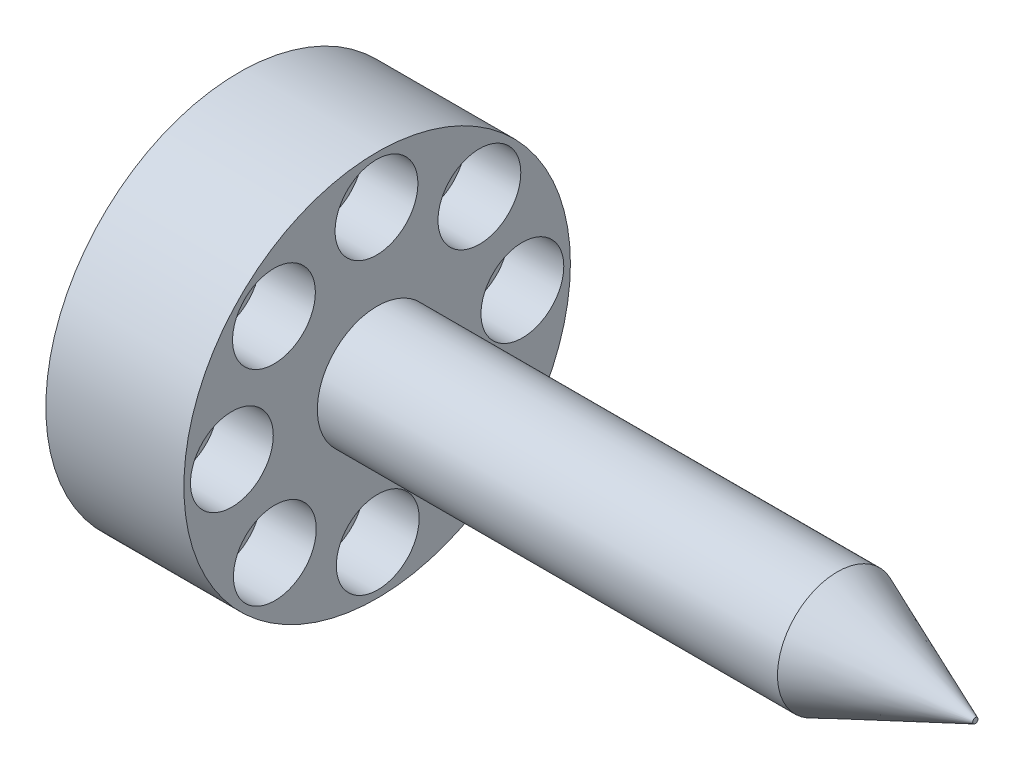
ISO-10303-21;
HEADER;
FILE_DESCRIPTION(('STEP AP214'),'2;1');
FILE_NAME('part.step','',(''),(''),'','','');
FILE_SCHEMA(('AUTOMOTIVE_DESIGN { 1 0 10303 214 1 1 1 1 }'));
ENDSEC;
DATA;
#1=APPLICATION_CONTEXT('core data for automotive mechanical design processes');
#2=APPLICATION_PROTOCOL_DEFINITION('international standard','automotive_design',2000,#1);
#3=PRODUCT_CONTEXT('',#1,'mechanical');
#4=PRODUCT('Part','Part','',(#3));
#5=PRODUCT_RELATED_PRODUCT_CATEGORY('part','',(#4));
#6=PRODUCT_DEFINITION_FORMATION('','',#4);
#7=PRODUCT_DEFINITION_CONTEXT('part definition',#1,'design');
#8=PRODUCT_DEFINITION('design','',#6,#7);
#9=PRODUCT_DEFINITION_SHAPE('','',#8);
#10=(LENGTH_UNIT() NAMED_UNIT(*) SI_UNIT(.MILLI.,.METRE.));
#11=(NAMED_UNIT(*) PLANE_ANGLE_UNIT() SI_UNIT($,.RADIAN.));
#12=(NAMED_UNIT(*) SI_UNIT($,.STERADIAN.) SOLID_ANGLE_UNIT());
#13=UNCERTAINTY_MEASURE_WITH_UNIT(LENGTH_MEASURE(1.E-05),#10,'distance_accuracy_value','');
#14=(GEOMETRIC_REPRESENTATION_CONTEXT(3) GLOBAL_UNCERTAINTY_ASSIGNED_CONTEXT((#13)) GLOBAL_UNIT_ASSIGNED_CONTEXT((#10,
#11,#12)) REPRESENTATION_CONTEXT('',''));
#15=CARTESIAN_POINT('',(0.,0.,0.));
#16=DIRECTION('',(0.,0.,1.));
#17=DIRECTION('',(1.,0.,0.));
#18=AXIS2_PLACEMENT_3D('',#15,#16,#17);
#19=CARTESIAN_POINT('',(-3515.,11.1151543393578,761.158666766789));
#20=DIRECTION('',(1.,0.,0.));
#21=DIRECTION('',(0.,0.,-1.));
#22=AXIS2_PLACEMENT_3D('',#19,#20,#21);
#23=CYLINDRICAL_SURFACE('',#22,2.50000000000002);
#24=CARTESIAN_POINT('',(470.,11.1151543393578,761.158666766789));
#25=DIRECTION('',(1.,0.,0.));
#26=DIRECTION('',(0.,0.,-1.));
#27=AXIS2_PLACEMENT_3D('',#24,#25,#26);
#28=CIRCLE('',#27,2.50000000000002);
#29=CARTESIAN_POINT('',(470.,11.1151543393578,758.658666766789));
#30=VERTEX_POINT('',#29);
#31=EDGE_CURVE('E50',#30,#30,#28,.T.);
#32=ORIENTED_EDGE('',*,*,#31,.F.);
#33=EDGE_LOOP('',(#32));
#34=FACE_BOUND('',#33,.T.);
#35=CARTESIAN_POINT('',(479.,11.1151543393578,761.158666766789));
#36=DIRECTION('',(1.,0.,0.));
#37=DIRECTION('',(0.,0.,-1.));
#38=AXIS2_PLACEMENT_3D('',#35,#36,#37);
#39=CIRCLE('',#38,2.50000000000002);
#40=CARTESIAN_POINT('',(479.,11.1151543393578,758.658666766789));
#41=VERTEX_POINT('',#40);
#42=EDGE_CURVE('E97',#41,#41,#39,.T.);
#43=ORIENTED_EDGE('',*,*,#42,.T.);
#44=EDGE_LOOP('',(#43));
#45=FACE_BOUND('',#44,.T.);
#46=ADVANCED_FACE('F33',(#34,#45),#23,.F.);
#47=CARTESIAN_POINT('',(-3515.,-15.7499699470931,749.969232067497));
#48=DIRECTION('',(1.,0.,0.));
#49=DIRECTION('',(0.,0.,-1.));
#50=AXIS2_PLACEMENT_3D('',#47,#48,#49);
#51=CYLINDRICAL_SURFACE('',#50,2.50000000000009);
#52=CARTESIAN_POINT('',(470.,-15.7499699470931,749.969232067497));
#53=DIRECTION('',(1.,0.,0.));
#54=DIRECTION('',(0.,0.,-1.));
#55=AXIS2_PLACEMENT_3D('',#52,#53,#54);
#56=CIRCLE('',#55,2.50000000000009);
#57=CARTESIAN_POINT('',(470.,-15.7499699470931,747.469232067497));
#58=VERTEX_POINT('',#57);
#59=EDGE_CURVE('E53',#58,#58,#56,.T.);
#60=ORIENTED_EDGE('',*,*,#59,.F.);
#61=EDGE_LOOP('',(#60));
#62=FACE_BOUND('',#61,.T.);
#63=CARTESIAN_POINT('',(479.,-15.7499699470931,749.969232067497));
#64=DIRECTION('',(1.,0.,0.));
#65=DIRECTION('',(0.,0.,-1.));
#66=AXIS2_PLACEMENT_3D('',#63,#64,#65);
#67=CIRCLE('',#66,2.50000000000009);
#68=CARTESIAN_POINT('',(479.,-15.7499699470931,747.469232067497));
#69=VERTEX_POINT('',#68);
#70=EDGE_CURVE('E124',#69,#69,#67,.T.);
#71=ORIENTED_EDGE('',*,*,#70,.T.);
#72=EDGE_LOOP('',(#71));
#73=FACE_BOUND('',#72,.T.);
#74=ADVANCED_FACE('F195',(#62,#73),#51,.F.);
#75=CARTESIAN_POINT('',(-3515.,-11.1586667667896,761.115154339358));
#76=DIRECTION('',(1.,0.,0.));
#77=DIRECTION('',(0.,0.,-1.));
#78=AXIS2_PLACEMENT_3D('',#75,#76,#77);
#79=CYLINDRICAL_SURFACE('',#78,2.50000000000001);
#80=CARTESIAN_POINT('',(470.,-11.1586667667896,761.115154339358));
#81=DIRECTION('',(1.,0.,0.));
#82=DIRECTION('',(0.,0.,-1.));
#83=AXIS2_PLACEMENT_3D('',#80,#81,#82);
#84=CIRCLE('',#83,2.50000000000001);
#85=CARTESIAN_POINT('',(470.,-11.1586667667896,758.615154339358));
#86=VERTEX_POINT('',#85);
#87=EDGE_CURVE('E57',#86,#86,#84,.T.);
#88=ORIENTED_EDGE('',*,*,#87,.F.);
#89=EDGE_LOOP('',(#88));
#90=FACE_BOUND('',#89,.T.);
#91=CARTESIAN_POINT('',(479.,-11.1586667667896,761.115154339358));
#92=DIRECTION('',(1.,0.,0.));
#93=DIRECTION('',(0.,0.,-1.));
#94=AXIS2_PLACEMENT_3D('',#91,#92,#93);
#95=CIRCLE('',#94,2.50000000000001);
#96=CARTESIAN_POINT('',(479.,-11.1586667667896,758.615154339358));
#97=VERTEX_POINT('',#96);
#98=EDGE_CURVE('E115',#97,#97,#95,.T.);
#99=ORIENTED_EDGE('',*,*,#98,.T.);
#100=EDGE_LOOP('',(#99));
#101=FACE_BOUND('',#100,.T.);
#102=ADVANCED_FACE('F201',(#90,#101),#79,.F.);
#103=CARTESIAN_POINT('',(-3515.,-0.0307679325027843,765.749969947093));
#104=DIRECTION('',(1.,0.,0.));
#105=DIRECTION('',(0.,0.,-1.));
#106=AXIS2_PLACEMENT_3D('',#103,#104,#105);
#107=CYLINDRICAL_SURFACE('',#106,2.50000000000003);
#108=CARTESIAN_POINT('',(470.,-0.0307679325027843,765.749969947093));
#109=DIRECTION('',(1.,0.,0.));
#110=DIRECTION('',(0.,0.,-1.));
#111=AXIS2_PLACEMENT_3D('',#108,#109,#110);
#112=CIRCLE('',#111,2.50000000000003);
#113=CARTESIAN_POINT('',(470.,-0.0307679325027843,763.249969947093));
#114=VERTEX_POINT('',#113);
#115=EDGE_CURVE('E60',#114,#114,#112,.T.);
#116=ORIENTED_EDGE('',*,*,#115,.F.);
#117=EDGE_LOOP('',(#116));
#118=FACE_BOUND('',#117,.T.);
#119=CARTESIAN_POINT('',(479.,-0.0307679325027843,765.749969947093));
#120=DIRECTION('',(1.,0.,0.));
#121=DIRECTION('',(0.,0.,-1.));
#122=AXIS2_PLACEMENT_3D('',#119,#120,#121);
#123=CIRCLE('',#122,2.50000000000003);
#124=CARTESIAN_POINT('',(479.,-0.0307679325027843,763.249969947093));
#125=VERTEX_POINT('',#124);
#126=EDGE_CURVE('E107',#125,#125,#123,.T.);
#127=ORIENTED_EDGE('',*,*,#126,.T.);
#128=EDGE_LOOP('',(#127));
#129=FACE_BOUND('',#128,.T.);
#130=ADVANCED_FACE('F301',(#118,#129),#107,.F.);
#131=CARTESIAN_POINT('',(-3515.,-11.1151543393581,738.84133323321));
#132=DIRECTION('',(1.,0.,0.));
#133=DIRECTION('',(0.,0.,-1.));
#134=AXIS2_PLACEMENT_3D('',#131,#132,#133);
#135=CYLINDRICAL_SURFACE('',#134,2.50000000000002);
#136=CARTESIAN_POINT('',(470.,-11.1151543393581,738.84133323321));
#137=DIRECTION('',(1.,0.,0.));
#138=DIRECTION('',(0.,0.,-1.));
#139=AXIS2_PLACEMENT_3D('',#136,#137,#138);
#140=CIRCLE('',#139,2.50000000000002);
#141=CARTESIAN_POINT('',(470.,-11.1151543393581,736.34133323321));
#142=VERTEX_POINT('',#141);
#143=EDGE_CURVE('E63',#142,#142,#140,.T.);
#144=ORIENTED_EDGE('',*,*,#143,.F.);
#145=EDGE_LOOP('',(#144));
#146=FACE_BOUND('',#145,.T.);
#147=CARTESIAN_POINT('',(479.,-11.1151543393581,738.84133323321));
#148=DIRECTION('',(1.,0.,0.));
#149=DIRECTION('',(0.,0.,-1.));
#150=AXIS2_PLACEMENT_3D('',#147,#148,#149);
#151=CIRCLE('',#150,2.50000000000002);
#152=CARTESIAN_POINT('',(479.,-11.1151543393581,736.34133323321));
#153=VERTEX_POINT('',#152);
#154=EDGE_CURVE('E133',#153,#153,#151,.T.);
#155=ORIENTED_EDGE('',*,*,#154,.T.);
#156=EDGE_LOOP('',(#155));
#157=FACE_BOUND('',#156,.T.);
#158=ADVANCED_FACE('F208',(#146,#157),#135,.F.);
#159=CARTESIAN_POINT('',(-3515.,0.0307679325023402,734.250030052907));
#160=DIRECTION('',(1.,0.,0.));
#161=DIRECTION('',(0.,0.,-1.));
#162=AXIS2_PLACEMENT_3D('',#159,#160,#161);
#163=CYLINDRICAL_SURFACE('',#162,2.50000000000003);
#164=CARTESIAN_POINT('',(470.,0.0307679325023402,734.250030052907));
#165=DIRECTION('',(1.,0.,0.));
#166=DIRECTION('',(0.,0.,-1.));
#167=AXIS2_PLACEMENT_3D('',#164,#165,#166);
#168=CIRCLE('',#167,2.50000000000003);
#169=CARTESIAN_POINT('',(470.,0.0307679325023402,731.750030052907));
#170=VERTEX_POINT('',#169);
#171=EDGE_CURVE('E66',#170,#170,#168,.T.);
#172=ORIENTED_EDGE('',*,*,#171,.F.);
#173=EDGE_LOOP('',(#172));
#174=FACE_BOUND('',#173,.T.);
#175=CARTESIAN_POINT('',(479.,0.0307679325023402,734.250030052907));
#176=DIRECTION('',(1.,0.,0.));
#177=DIRECTION('',(0.,0.,-1.));
#178=AXIS2_PLACEMENT_3D('',#175,#176,#177);
#179=CIRCLE('',#178,2.50000000000003);
#180=CARTESIAN_POINT('',(479.,0.0307679325023402,731.750030052907));
#181=VERTEX_POINT('',#180);
#182=EDGE_CURVE('E142',#181,#181,#179,.T.);
#183=ORIENTED_EDGE('',*,*,#182,.T.);
#184=EDGE_LOOP('',(#183));
#185=FACE_BOUND('',#184,.T.);
#186=ADVANCED_FACE('F309',(#174,#185),#163,.F.);
#187=CARTESIAN_POINT('',(-3515.,11.1586667667893,738.884845660642));
#188=DIRECTION('',(1.,0.,0.));
#189=DIRECTION('',(0.,0.,-1.));
#190=AXIS2_PLACEMENT_3D('',#187,#188,#189);
#191=CYLINDRICAL_SURFACE('',#190,2.50000000000002);
#192=CARTESIAN_POINT('',(470.,11.1586667667893,738.884845660642));
#193=DIRECTION('',(1.,0.,0.));
#194=DIRECTION('',(0.,0.,-1.));
#195=AXIS2_PLACEMENT_3D('',#192,#193,#194);
#196=CIRCLE('',#195,2.50000000000002);
#197=CARTESIAN_POINT('',(470.,11.1586667667893,736.384845660642));
#198=VERTEX_POINT('',#197);
#199=EDGE_CURVE('E68',#198,#198,#196,.T.);
#200=ORIENTED_EDGE('',*,*,#199,.F.);
#201=EDGE_LOOP('',(#200));
#202=FACE_BOUND('',#201,.T.);
#203=CARTESIAN_POINT('',(479.,11.1586667667893,738.884845660642));
#204=DIRECTION('',(1.,0.,0.));
#205=DIRECTION('',(0.,0.,-1.));
#206=AXIS2_PLACEMENT_3D('',#203,#204,#205);
#207=CIRCLE('',#206,2.50000000000002);
#208=CARTESIAN_POINT('',(479.,11.1586667667893,736.384845660642));
#209=VERTEX_POINT('',#208);
#210=EDGE_CURVE('E151',#209,#209,#207,.T.);
#211=ORIENTED_EDGE('',*,*,#210,.T.);
#212=EDGE_LOOP('',(#211));
#213=FACE_BOUND('',#212,.T.);
#214=ADVANCED_FACE('F157',(#202,#213),#191,.F.);
#215=CARTESIAN_POINT('',(-3515.,15.7499699470927,750.030767932502));
#216=DIRECTION('',(1.,0.,0.));
#217=DIRECTION('',(0.,0.,-1.));
#218=AXIS2_PLACEMENT_3D('',#215,#216,#217);
#219=CYLINDRICAL_SURFACE('',#218,2.50000000000003);
#220=CARTESIAN_POINT('',(470.,15.7499699470927,750.030767932502));
#221=DIRECTION('',(1.,0.,0.));
#222=DIRECTION('',(0.,0.,-1.));
#223=AXIS2_PLACEMENT_3D('',#220,#221,#222);
#224=CIRCLE('',#223,2.50000000000003);
#225=CARTESIAN_POINT('',(470.,15.7499699470927,747.530767932502));
#226=VERTEX_POINT('',#225);
#227=EDGE_CURVE('E37',#226,#226,#224,.T.);
#228=ORIENTED_EDGE('',*,*,#227,.F.);
#229=EDGE_LOOP('',(#228));
#230=FACE_BOUND('',#229,.T.);
#231=CARTESIAN_POINT('',(479.,15.7499699470927,750.030767932502));
#232=DIRECTION('',(1.,0.,0.));
#233=DIRECTION('',(0.,0.,-1.));
#234=AXIS2_PLACEMENT_3D('',#231,#232,#233);
#235=CIRCLE('',#234,2.50000000000003);
#236=CARTESIAN_POINT('',(479.,15.7499699470927,747.530767932502));
#237=VERTEX_POINT('',#236);
#238=EDGE_CURVE('E88',#237,#237,#235,.T.);
#239=ORIENTED_EDGE('',*,*,#238,.T.);
#240=EDGE_LOOP('',(#239));
#241=FACE_BOUND('',#240,.T.);
#242=ADVANCED_FACE('F187',(#230,#241),#219,.F.);
#243=CARTESIAN_POINT('',(485.,0.,750.));
#244=DIRECTION('',(-1.,0.,0.));
#245=DIRECTION('',(0.,0.,1.));
#246=AXIS2_PLACEMENT_3D('',#243,#244,#245);
#247=CYLINDRICAL_SURFACE('',#246,21.);
#248=CARTESIAN_POINT('',(485.,0.,750.));
#249=DIRECTION('',(1.,0.,0.));
#250=DIRECTION('',(0.,0.,-1.));
#251=AXIS2_PLACEMENT_3D('',#248,#249,#250);
#252=CIRCLE('',#251,21.);
#253=CARTESIAN_POINT('',(485.,0.,729.));
#254=VERTEX_POINT('',#253);
#255=EDGE_CURVE('E77',#254,#254,#252,.T.);
#256=ORIENTED_EDGE('',*,*,#255,.F.);
#257=EDGE_LOOP('',(#256));
#258=FACE_BOUND('',#257,.T.);
#259=CARTESIAN_POINT('',(470.,0.,750.));
#260=DIRECTION('',(1.,0.,0.));
#261=DIRECTION('',(0.,0.,-1.));
#262=AXIS2_PLACEMENT_3D('',#259,#260,#261);
#263=CIRCLE('',#262,21.);
#264=CARTESIAN_POINT('',(470.,0.,729.));
#265=VERTEX_POINT('',#264);
#266=EDGE_CURVE('E73',#265,#265,#263,.T.);
#267=ORIENTED_EDGE('',*,*,#266,.T.);
#268=EDGE_LOOP('',(#267));
#269=FACE_BOUND('',#268,.T.);
#270=ADVANCED_FACE('F177',(#258,#269),#247,.T.);
#271=CARTESIAN_POINT('',(485.,0.,750.));
#272=DIRECTION('',(1.,0.,0.));
#273=DIRECTION('',(0.,0.,-1.));
#274=AXIS2_PLACEMENT_3D('',#271,#272,#273);
#275=PLANE('',#274);
#276=CARTESIAN_POINT('',(485.,11.162397860185,761.21149181539));
#277=DIRECTION('',(1.,0.,0.));
#278=DIRECTION('',(0.,0.,-1.));
#279=AXIS2_PLACEMENT_3D('',#276,#277,#278);
#280=CIRCLE('',#279,4.49999999999991);
#281=CARTESIAN_POINT('',(485.,11.162397860185,756.71149181539));
#282=VERTEX_POINT('',#281);
#283=EDGE_CURVE('E94',#282,#282,#280,.T.);
#284=ORIENTED_EDGE('',*,*,#283,.F.);
#285=EDGE_LOOP('',(#284));
#286=FACE_BOUND('',#285,.T.);
#287=CARTESIAN_POINT('',(485.,-0.0180865978707256,765.786166924923));
#288=DIRECTION('',(1.,0.,0.));
#289=DIRECTION('',(0.,0.,-1.));
#290=AXIS2_PLACEMENT_3D('',#287,#288,#289);
#291=CIRCLE('',#290,4.49999999999979);
#292=CARTESIAN_POINT('',(485.,-0.0180865978707256,761.286166924924));
#293=VERTEX_POINT('',#292);
#294=EDGE_CURVE('E101',#293,#293,#291,.T.);
#295=ORIENTED_EDGE('',*,*,#294,.F.);
#296=EDGE_LOOP('',(#295));
#297=FACE_BOUND('',#296,.T.);
#298=CARTESIAN_POINT('',(485.,-11.1586667667896,761.115154339358));
#299=DIRECTION('',(1.,0.,0.));
#300=DIRECTION('',(0.,0.,-1.));
#301=AXIS2_PLACEMENT_3D('',#298,#299,#300);
#302=CIRCLE('',#301,4.49999999999991);
#303=CARTESIAN_POINT('',(485.,-11.1586667667896,756.615154339358));
#304=VERTEX_POINT('',#303);
#305=EDGE_CURVE('E110',#304,#304,#302,.T.);
#306=ORIENTED_EDGE('',*,*,#305,.F.);
#307=EDGE_LOOP('',(#306));
#308=FACE_BOUND('',#307,.T.);
#309=CARTESIAN_POINT('',(485.,-15.7333418763235,749.934669881302));
#310=DIRECTION('',(1.,0.,0.));
#311=DIRECTION('',(0.,0.,-1.));
#312=AXIS2_PLACEMENT_3D('',#309,#310,#311);
#313=CIRCLE('',#312,4.49999999999979);
#314=CARTESIAN_POINT('',(485.,-15.7333418763235,745.434669881303));
#315=VERTEX_POINT('',#314);
#316=EDGE_CURVE('E119',#315,#315,#313,.T.);
#317=ORIENTED_EDGE('',*,*,#316,.F.);
#318=EDGE_LOOP('',(#317));
#319=FACE_BOUND('',#318,.T.);
#320=CARTESIAN_POINT('',(485.,-11.062329290758,738.794089712383));
#321=DIRECTION('',(1.,0.,0.));
#322=DIRECTION('',(0.,0.,-1.));
#323=AXIS2_PLACEMENT_3D('',#320,#321,#322);
#324=CIRCLE('',#323,4.49999999999991);
#325=CARTESIAN_POINT('',(485.,-11.062329290758,734.294089712383));
#326=VERTEX_POINT('',#325);
#327=EDGE_CURVE('E128',#326,#326,#324,.T.);
#328=ORIENTED_EDGE('',*,*,#327,.F.);
#329=EDGE_LOOP('',(#328));
#330=FACE_BOUND('',#329,.T.);
#331=CARTESIAN_POINT('',(485.,0.11815516729774,734.219414602849));
#332=DIRECTION('',(1.,0.,0.));
#333=DIRECTION('',(0.,0.,-1.));
#334=AXIS2_PLACEMENT_3D('',#331,#332,#333);
#335=CIRCLE('',#334,4.49999999999979);
#336=CARTESIAN_POINT('',(485.,0.11815516729774,729.71941460285));
#337=VERTEX_POINT('',#336);
#338=EDGE_CURVE('E137',#337,#337,#335,.T.);
#339=ORIENTED_EDGE('',*,*,#338,.F.);
#340=EDGE_LOOP('',(#339));
#341=FACE_BOUND('',#340,.T.);
#342=CARTESIAN_POINT('',(485.,11.2587353362167,738.890427188415));
#343=DIRECTION('',(1.,0.,0.));
#344=DIRECTION('',(0.,0.,-1.));
#345=AXIS2_PLACEMENT_3D('',#342,#343,#344);
#346=CIRCLE('',#345,4.49999999999991);
#347=CARTESIAN_POINT('',(485.,11.2587353362167,734.390427188415));
#348=VERTEX_POINT('',#347);
#349=EDGE_CURVE('E146',#348,#348,#346,.T.);
#350=ORIENTED_EDGE('',*,*,#349,.F.);
#351=EDGE_LOOP('',(#350));
#352=FACE_BOUND('',#351,.T.);
#353=CARTESIAN_POINT('',(485.,15.8334104457505,750.070911646471));
#354=DIRECTION('',(1.,0.,0.));
#355=DIRECTION('',(0.,0.,-1.));
#356=AXIS2_PLACEMENT_3D('',#353,#354,#355);
#357=CIRCLE('',#356,4.49999999999991);
#358=CARTESIAN_POINT('',(485.,15.8334104457505,745.570911646471));
#359=VERTEX_POINT('',#358);
#360=EDGE_CURVE('E85',#359,#359,#357,.T.);
#361=ORIENTED_EDGE('',*,*,#360,.F.);
#362=EDGE_LOOP('',(#361));
#363=FACE_BOUND('',#362,.T.);
#364=CARTESIAN_POINT('',(485.,0.,750.));
#365=DIRECTION('',(1.,0.,0.));
#366=DIRECTION('',(0.,0.,-1.));
#367=AXIS2_PLACEMENT_3D('',#364,#365,#366);
#368=CIRCLE('',#367,6.4999999999999);
#369=CARTESIAN_POINT('',(485.,0.,743.5));
#370=VERTEX_POINT('',#369);
#371=EDGE_CURVE('E46',#370,#370,#368,.T.);
#372=ORIENTED_EDGE('',*,*,#371,.F.);
#373=EDGE_LOOP('',(#372));
#374=FACE_BOUND('',#373,.T.);
#375=ORIENTED_EDGE('',*,*,#255,.T.);
#376=EDGE_LOOP('',(#375));
#377=FACE_BOUND('',#376,.T.);
#378=ADVANCED_FACE('F173',(#286,#297,#308,#319,#330,#341,#352,#363,#374,#377),#275,.T.);
#379=CARTESIAN_POINT('',(470.,0.,750.));
#380=DIRECTION('',(1.,0.,0.));
#381=DIRECTION('',(0.,0.,-1.));
#382=AXIS2_PLACEMENT_3D('',#379,#380,#381);
#383=PLANE('',#382);
#384=ORIENTED_EDGE('',*,*,#227,.T.);
#385=EDGE_LOOP('',(#384));
#386=FACE_BOUND('',#385,.T.);
#387=ORIENTED_EDGE('',*,*,#199,.T.);
#388=EDGE_LOOP('',(#387));
#389=FACE_BOUND('',#388,.T.);
#390=ORIENTED_EDGE('',*,*,#171,.T.);
#391=EDGE_LOOP('',(#390));
#392=FACE_BOUND('',#391,.T.);
#393=ORIENTED_EDGE('',*,*,#143,.T.);
#394=EDGE_LOOP('',(#393));
#395=FACE_BOUND('',#394,.T.);
#396=ORIENTED_EDGE('',*,*,#115,.T.);
#397=EDGE_LOOP('',(#396));
#398=FACE_BOUND('',#397,.T.);
#399=ORIENTED_EDGE('',*,*,#87,.T.);
#400=EDGE_LOOP('',(#399));
#401=FACE_BOUND('',#400,.T.);
#402=ORIENTED_EDGE('',*,*,#59,.T.);
#403=EDGE_LOOP('',(#402));
#404=FACE_BOUND('',#403,.T.);
#405=ORIENTED_EDGE('',*,*,#31,.T.);
#406=EDGE_LOOP('',(#405));
#407=FACE_BOUND('',#406,.T.);
#408=ORIENTED_EDGE('',*,*,#266,.F.);
#409=EDGE_LOOP('',(#408));
#410=FACE_BOUND('',#409,.T.);
#411=ADVANCED_FACE('F176',(#386,#389,#392,#395,#398,#401,#404,#407,#410),#383,.F.);
#412=CARTESIAN_POINT('',(550.,0.,750.));
#413=DIRECTION('',(-1.,0.,0.));
#414=DIRECTION('',(0.,0.,1.));
#415=AXIS2_PLACEMENT_3D('',#412,#413,#414);
#416=CYLINDRICAL_SURFACE('',#415,6.4999999999999);
#417=CARTESIAN_POINT('',(535.,0.,750.));
#418=DIRECTION('',(1.,0.,0.));
#419=DIRECTION('',(0.,0.,-1.));
#420=AXIS2_PLACEMENT_3D('',#417,#418,#419);
#421=CIRCLE('',#420,6.4999999999999);
#422=CARTESIAN_POINT('',(535.,0.,743.5));
#423=VERTEX_POINT('',#422);
#424=EDGE_CURVE('E10',#423,#423,#421,.F.);
#425=ORIENTED_EDGE('',*,*,#424,.T.);
#426=EDGE_LOOP('',(#425));
#427=FACE_BOUND('',#426,.T.);
#428=ORIENTED_EDGE('',*,*,#371,.T.);
#429=EDGE_LOOP('',(#428));
#430=FACE_BOUND('',#429,.T.);
#431=ADVANCED_FACE('F213',(#427,#430),#416,.T.);
#432=CARTESIAN_POINT('',(550.,0.,750.));
#433=DIRECTION('',(1.,0.,0.));
#434=DIRECTION('',(0.,0.,-1.));
#435=AXIS2_PLACEMENT_3D('',#432,#433,#434);
#436=PLANE('',#435);
#437=CARTESIAN_POINT('',(550.,0.,750.));
#438=DIRECTION('',(1.,0.,0.));
#439=DIRECTION('',(0.,0.,-1.));
#440=AXIS2_PLACEMENT_3D('',#437,#438,#439);
#441=CIRCLE('',#440,0.286796564403557);
#442=CARTESIAN_POINT('',(550.,0.,749.713203435596));
#443=VERTEX_POINT('',#442);
#444=EDGE_CURVE('E41',#443,#443,#441,.T.);
#445=ORIENTED_EDGE('',*,*,#444,.T.);
#446=EDGE_LOOP('',(#445));
#447=FACE_BOUND('',#446,.T.);
#448=ADVANCED_FACE('F210',(#447),#436,.T.);
#449=CARTESIAN_POINT('',(550.,0.,750.));
#450=DIRECTION('',(-1.,0.,0.));
#451=DIRECTION('',(0.,0.,1.));
#452=AXIS2_PLACEMENT_3D('',#449,#450,#451);
#453=CONICAL_SURFACE('',#452,0.286796564403557,0.392699081698725);
#454=ORIENTED_EDGE('',*,*,#424,.F.);
#455=EDGE_LOOP('',(#454));
#456=FACE_BOUND('',#455,.T.);
#457=ORIENTED_EDGE('',*,*,#444,.F.);
#458=EDGE_LOOP('',(#457));
#459=FACE_BOUND('',#458,.T.);
#460=ADVANCED_FACE('F35',(#456,#459),#453,.T.);
#461=CARTESIAN_POINT('',(479.,15.8334104457505,750.070911646471));
#462=DIRECTION('',(1.,0.,0.));
#463=DIRECTION('',(0.,0.,-1.));
#464=AXIS2_PLACEMENT_3D('',#461,#462,#463);
#465=CYLINDRICAL_SURFACE('',#464,4.49999999999991);
#466=CARTESIAN_POINT('',(479.,15.8334104457505,750.070911646471));
#467=DIRECTION('',(1.,0.,0.));
#468=DIRECTION('',(0.,0.,-1.));
#469=AXIS2_PLACEMENT_3D('',#466,#467,#468);
#470=CIRCLE('',#469,4.49999999999991);
#471=CARTESIAN_POINT('',(479.,15.8334104457505,745.570911646471));
#472=VERTEX_POINT('',#471);
#473=EDGE_CURVE('E54',#472,#472,#470,.T.);
#474=ORIENTED_EDGE('',*,*,#473,.F.);
#475=EDGE_LOOP('',(#474));
#476=FACE_BOUND('',#475,.T.);
#477=ORIENTED_EDGE('',*,*,#360,.T.);
#478=EDGE_LOOP('',(#477));
#479=FACE_BOUND('',#478,.T.);
#480=ADVANCED_FACE('F296',(#476,#479),#465,.F.);
#481=CARTESIAN_POINT('',(479.,0.,0.));
#482=DIRECTION('',(1.,0.,0.));
#483=DIRECTION('',(0.,0.,-1.));
#484=AXIS2_PLACEMENT_3D('',#481,#482,#483);
#485=PLANE('',#484);
#486=ORIENTED_EDGE('',*,*,#238,.F.);
#487=EDGE_LOOP('',(#486));
#488=FACE_BOUND('',#487,.T.);
#489=ORIENTED_EDGE('',*,*,#473,.T.);
#490=EDGE_LOOP('',(#489));
#491=FACE_BOUND('',#490,.T.);
#492=ADVANCED_FACE('F169',(#488,#491),#485,.T.);
#493=CARTESIAN_POINT('',(479.,11.2587353362167,738.890427188415));
#494=DIRECTION('',(1.,0.,0.));
#495=DIRECTION('',(0.,0.,-1.));
#496=AXIS2_PLACEMENT_3D('',#493,#494,#495);
#497=CYLINDRICAL_SURFACE('',#496,4.49999999999991);
#498=CARTESIAN_POINT('',(479.,11.2587353362167,738.890427188415));
#499=DIRECTION('',(1.,0.,0.));
#500=DIRECTION('',(0.,0.,-1.));
#501=AXIS2_PLACEMENT_3D('',#498,#499,#500);
#502=CIRCLE('',#501,4.49999999999991);
#503=CARTESIAN_POINT('',(479.,11.2587353362167,734.390427188415));
#504=VERTEX_POINT('',#503);
#505=EDGE_CURVE('E89',#504,#504,#502,.T.);
#506=ORIENTED_EDGE('',*,*,#505,.F.);
#507=EDGE_LOOP('',(#506));
#508=FACE_BOUND('',#507,.T.);
#509=ORIENTED_EDGE('',*,*,#349,.T.);
#510=EDGE_LOOP('',(#509));
#511=FACE_BOUND('',#510,.T.);
#512=ADVANCED_FACE('F163',(#508,#511),#497,.F.);
#513=CARTESIAN_POINT('',(479.,0.,0.));
#514=DIRECTION('',(1.,0.,0.));
#515=DIRECTION('',(0.,0.,-1.));
#516=AXIS2_PLACEMENT_3D('',#513,#514,#515);
#517=PLANE('',#516);
#518=ORIENTED_EDGE('',*,*,#210,.F.);
#519=EDGE_LOOP('',(#518));
#520=FACE_BOUND('',#519,.T.);
#521=ORIENTED_EDGE('',*,*,#505,.T.);
#522=EDGE_LOOP('',(#521));
#523=FACE_BOUND('',#522,.T.);
#524=ADVANCED_FACE('F159',(#520,#523),#517,.T.);
#525=CARTESIAN_POINT('',(479.,0.11815516729774,734.219414602849));
#526=DIRECTION('',(1.,0.,0.));
#527=DIRECTION('',(0.,0.,-1.));
#528=AXIS2_PLACEMENT_3D('',#525,#526,#527);
#529=CYLINDRICAL_SURFACE('',#528,4.49999999999979);
#530=CARTESIAN_POINT('',(479.,0.11815516729774,734.219414602849));
#531=DIRECTION('',(1.,0.,0.));
#532=DIRECTION('',(0.,0.,-1.));
#533=AXIS2_PLACEMENT_3D('',#530,#531,#532);
#534=CIRCLE('',#533,4.49999999999979);
#535=CARTESIAN_POINT('',(479.,0.11815516729774,729.71941460285));
#536=VERTEX_POINT('',#535);
#537=EDGE_CURVE('E143',#536,#536,#534,.T.);
#538=ORIENTED_EDGE('',*,*,#537,.F.);
#539=EDGE_LOOP('',(#538));
#540=FACE_BOUND('',#539,.T.);
#541=ORIENTED_EDGE('',*,*,#338,.T.);
#542=EDGE_LOOP('',(#541));
#543=FACE_BOUND('',#542,.T.);
#544=ADVANCED_FACE('F162',(#540,#543),#529,.F.);
#545=CARTESIAN_POINT('',(479.,0.,0.));
#546=DIRECTION('',(1.,0.,0.));
#547=DIRECTION('',(0.,0.,-1.));
#548=AXIS2_PLACEMENT_3D('',#545,#546,#547);
#549=PLANE('',#548);
#550=ORIENTED_EDGE('',*,*,#182,.F.);
#551=EDGE_LOOP('',(#550));
#552=FACE_BOUND('',#551,.T.);
#553=ORIENTED_EDGE('',*,*,#537,.T.);
#554=EDGE_LOOP('',(#553));
#555=FACE_BOUND('',#554,.T.);
#556=ADVANCED_FACE('F254',(#552,#555),#549,.T.);
#557=CARTESIAN_POINT('',(479.,-11.062329290758,738.794089712383));
#558=DIRECTION('',(1.,0.,0.));
#559=DIRECTION('',(0.,0.,-1.));
#560=AXIS2_PLACEMENT_3D('',#557,#558,#559);
#561=CYLINDRICAL_SURFACE('',#560,4.49999999999991);
#562=CARTESIAN_POINT('',(479.,-11.062329290758,738.794089712383));
#563=DIRECTION('',(1.,0.,0.));
#564=DIRECTION('',(0.,0.,-1.));
#565=AXIS2_PLACEMENT_3D('',#562,#563,#564);
#566=CIRCLE('',#565,4.49999999999991);
#567=CARTESIAN_POINT('',(479.,-11.062329290758,734.294089712383));
#568=VERTEX_POINT('',#567);
#569=EDGE_CURVE('E134',#568,#568,#566,.T.);
#570=ORIENTED_EDGE('',*,*,#569,.F.);
#571=EDGE_LOOP('',(#570));
#572=FACE_BOUND('',#571,.T.);
#573=ORIENTED_EDGE('',*,*,#327,.T.);
#574=EDGE_LOOP('',(#573));
#575=FACE_BOUND('',#574,.T.);
#576=ADVANCED_FACE('F260',(#572,#575),#561,.F.);
#577=CARTESIAN_POINT('',(479.,0.,0.));
#578=DIRECTION('',(1.,0.,0.));
#579=DIRECTION('',(0.,0.,-1.));
#580=AXIS2_PLACEMENT_3D('',#577,#578,#579);
#581=PLANE('',#580);
#582=ORIENTED_EDGE('',*,*,#154,.F.);
#583=EDGE_LOOP('',(#582));
#584=FACE_BOUND('',#583,.T.);
#585=ORIENTED_EDGE('',*,*,#569,.T.);
#586=EDGE_LOOP('',(#585));
#587=FACE_BOUND('',#586,.T.);
#588=ADVANCED_FACE('F265',(#584,#587),#581,.T.);
#589=CARTESIAN_POINT('',(479.,-0.0180865978707256,765.786166924923));
#590=DIRECTION('',(1.,0.,0.));
#591=DIRECTION('',(0.,0.,-1.));
#592=AXIS2_PLACEMENT_3D('',#589,#590,#591);
#593=CYLINDRICAL_SURFACE('',#592,4.49999999999979);
#594=CARTESIAN_POINT('',(479.,-0.0180865978707256,765.786166924923));
#595=DIRECTION('',(1.,0.,0.));
#596=DIRECTION('',(0.,0.,-1.));
#597=AXIS2_PLACEMENT_3D('',#594,#595,#596);
#598=CIRCLE('',#597,4.49999999999979);
#599=CARTESIAN_POINT('',(479.,-0.0180865978707256,761.286166924924));
#600=VERTEX_POINT('',#599);
#601=EDGE_CURVE('E106',#600,#600,#598,.T.);
#602=ORIENTED_EDGE('',*,*,#601,.F.);
#603=EDGE_LOOP('',(#602));
#604=FACE_BOUND('',#603,.T.);
#605=ORIENTED_EDGE('',*,*,#294,.T.);
#606=EDGE_LOOP('',(#605));
#607=FACE_BOUND('',#606,.T.);
#608=ADVANCED_FACE('F268',(#604,#607),#593,.F.);
#609=CARTESIAN_POINT('',(479.,0.,0.));
#610=DIRECTION('',(1.,0.,0.));
#611=DIRECTION('',(0.,0.,-1.));
#612=AXIS2_PLACEMENT_3D('',#609,#610,#611);
#613=PLANE('',#612);
#614=ORIENTED_EDGE('',*,*,#601,.T.);
#615=EDGE_LOOP('',(#614));
#616=FACE_BOUND('',#615,.T.);
#617=ORIENTED_EDGE('',*,*,#126,.F.);
#618=EDGE_LOOP('',(#617));
#619=FACE_BOUND('',#618,.T.);
#620=ADVANCED_FACE('F279',(#616,#619),#613,.T.);
#621=CARTESIAN_POINT('',(479.,-11.1586667667896,761.115154339358));
#622=DIRECTION('',(1.,0.,0.));
#623=DIRECTION('',(0.,0.,-1.));
#624=AXIS2_PLACEMENT_3D('',#621,#622,#623);
#625=CYLINDRICAL_SURFACE('',#624,4.49999999999991);
#626=CARTESIAN_POINT('',(479.,-11.1586667667896,761.115154339358));
#627=DIRECTION('',(1.,0.,0.));
#628=DIRECTION('',(0.,0.,-1.));
#629=AXIS2_PLACEMENT_3D('',#626,#627,#628);
#630=CIRCLE('',#629,4.49999999999991);
#631=CARTESIAN_POINT('',(479.,-11.1586667667896,756.615154339358));
#632=VERTEX_POINT('',#631);
#633=EDGE_CURVE('E116',#632,#632,#630,.T.);
#634=ORIENTED_EDGE('',*,*,#633,.F.);
#635=EDGE_LOOP('',(#634));
#636=FACE_BOUND('',#635,.T.);
#637=ORIENTED_EDGE('',*,*,#305,.T.);
#638=EDGE_LOOP('',(#637));
#639=FACE_BOUND('',#638,.T.);
#640=ADVANCED_FACE('F275',(#636,#639),#625,.F.);
#641=CARTESIAN_POINT('',(479.,0.,0.));
#642=DIRECTION('',(1.,0.,0.));
#643=DIRECTION('',(0.,0.,-1.));
#644=AXIS2_PLACEMENT_3D('',#641,#642,#643);
#645=PLANE('',#644);
#646=ORIENTED_EDGE('',*,*,#98,.F.);
#647=EDGE_LOOP('',(#646));
#648=FACE_BOUND('',#647,.T.);
#649=ORIENTED_EDGE('',*,*,#633,.T.);
#650=EDGE_LOOP('',(#649));
#651=FACE_BOUND('',#650,.T.);
#652=ADVANCED_FACE('F244',(#648,#651),#645,.T.);
#653=CARTESIAN_POINT('',(479.,-15.7333418763235,749.934669881302));
#654=DIRECTION('',(1.,0.,0.));
#655=DIRECTION('',(0.,0.,-1.));
#656=AXIS2_PLACEMENT_3D('',#653,#654,#655);
#657=CYLINDRICAL_SURFACE('',#656,4.49999999999979);
#658=CARTESIAN_POINT('',(479.,-15.7333418763235,749.934669881302));
#659=DIRECTION('',(1.,0.,0.));
#660=DIRECTION('',(0.,0.,-1.));
#661=AXIS2_PLACEMENT_3D('',#658,#659,#660);
#662=CIRCLE('',#661,4.49999999999979);
#663=CARTESIAN_POINT('',(479.,-15.7333418763235,745.434669881303));
#664=VERTEX_POINT('',#663);
#665=EDGE_CURVE('E125',#664,#664,#662,.T.);
#666=ORIENTED_EDGE('',*,*,#665,.F.);
#667=EDGE_LOOP('',(#666));
#668=FACE_BOUND('',#667,.T.);
#669=ORIENTED_EDGE('',*,*,#316,.T.);
#670=EDGE_LOOP('',(#669));
#671=FACE_BOUND('',#670,.T.);
#672=ADVANCED_FACE('F238',(#668,#671),#657,.F.);
#673=CARTESIAN_POINT('',(479.,0.,0.));
#674=DIRECTION('',(1.,0.,0.));
#675=DIRECTION('',(0.,0.,-1.));
#676=AXIS2_PLACEMENT_3D('',#673,#674,#675);
#677=PLANE('',#676);
#678=ORIENTED_EDGE('',*,*,#70,.F.);
#679=EDGE_LOOP('',(#678));
#680=FACE_BOUND('',#679,.T.);
#681=ORIENTED_EDGE('',*,*,#665,.T.);
#682=EDGE_LOOP('',(#681));
#683=FACE_BOUND('',#682,.T.);
#684=ADVANCED_FACE('F234',(#680,#683),#677,.T.);
#685=CARTESIAN_POINT('',(479.,11.162397860185,761.21149181539));
#686=DIRECTION('',(1.,0.,0.));
#687=DIRECTION('',(0.,0.,-1.));
#688=AXIS2_PLACEMENT_3D('',#685,#686,#687);
#689=CYLINDRICAL_SURFACE('',#688,4.49999999999991);
#690=CARTESIAN_POINT('',(479.,11.162397860185,761.21149181539));
#691=DIRECTION('',(1.,0.,0.));
#692=DIRECTION('',(0.,0.,-1.));
#693=AXIS2_PLACEMENT_3D('',#690,#691,#692);
#694=CIRCLE('',#693,4.49999999999991);
#695=CARTESIAN_POINT('',(479.,11.162397860185,756.71149181539));
#696=VERTEX_POINT('',#695);
#697=EDGE_CURVE('E98',#696,#696,#694,.T.);
#698=ORIENTED_EDGE('',*,*,#697,.F.);
#699=EDGE_LOOP('',(#698));
#700=FACE_BOUND('',#699,.T.);
#701=ORIENTED_EDGE('',*,*,#283,.T.);
#702=EDGE_LOOP('',(#701));
#703=FACE_BOUND('',#702,.T.);
#704=ADVANCED_FACE('F237',(#700,#703),#689,.F.);
#705=CARTESIAN_POINT('',(479.,0.,0.));
#706=DIRECTION('',(1.,0.,0.));
#707=DIRECTION('',(0.,0.,-1.));
#708=AXIS2_PLACEMENT_3D('',#705,#706,#707);
#709=PLANE('',#708);
#710=ORIENTED_EDGE('',*,*,#42,.F.);
#711=EDGE_LOOP('',(#710));
#712=FACE_BOUND('',#711,.T.);
#713=ORIENTED_EDGE('',*,*,#697,.T.);
#714=EDGE_LOOP('',(#713));
#715=FACE_BOUND('',#714,.T.);
#716=ADVANCED_FACE('F287',(#712,#715),#709,.T.);
#717=CLOSED_SHELL('',(#46,#74,#102,#130,#158,#186,#214,#242,#270,#378,#411,#431,#448,#460,#480,
#492,#512,#524,#544,#556,#576,#588,#608,#620,#640,#652,#672,#684,#704,#716));
#718=MANIFOLD_SOLID_BREP('B2',#717);
#719=ADVANCED_BREP_SHAPE_REPRESENTATION('',(#18,#718),#14);
#720=SHAPE_DEFINITION_REPRESENTATION(#9,#719);
ENDSEC;
END-ISO-10303-21;
